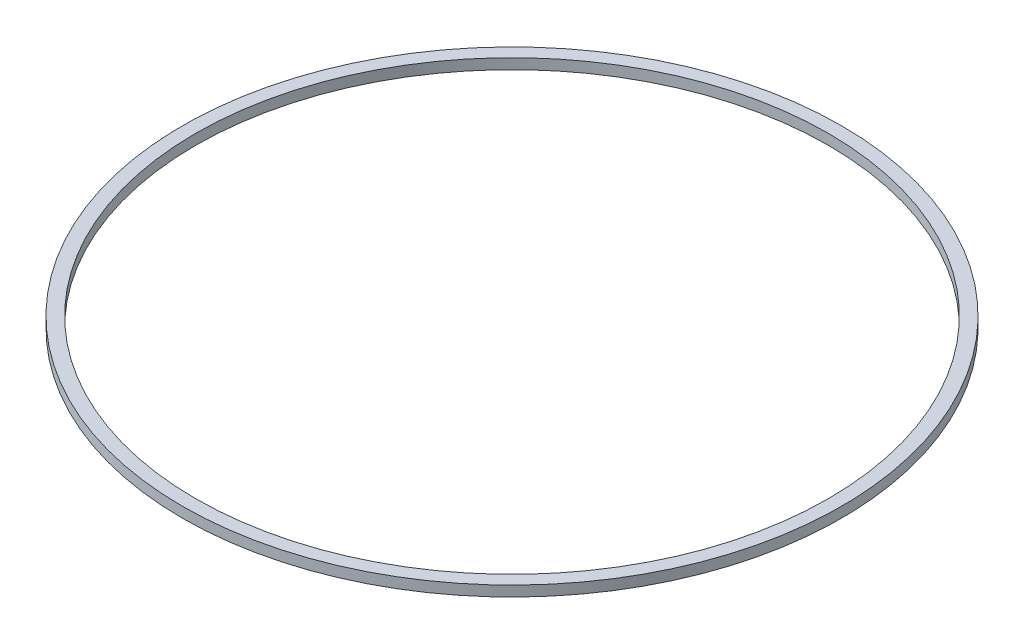
ISO-10303-21;
HEADER;
FILE_DESCRIPTION(('STEP AP214'),'2;1');
FILE_NAME('part.step','',(''),(''),'','','');
FILE_SCHEMA(('AUTOMOTIVE_DESIGN { 1 0 10303 214 1 1 1 1 }'));
ENDSEC;
DATA;
#1=APPLICATION_CONTEXT('core data for automotive mechanical design processes');
#2=APPLICATION_PROTOCOL_DEFINITION('international standard','automotive_design',2000,#1);
#3=PRODUCT_CONTEXT('',#1,'mechanical');
#4=PRODUCT('Part','Part','',(#3));
#5=PRODUCT_RELATED_PRODUCT_CATEGORY('part','',(#4));
#6=PRODUCT_DEFINITION_FORMATION('','',#4);
#7=PRODUCT_DEFINITION_CONTEXT('part definition',#1,'design');
#8=PRODUCT_DEFINITION('design','',#6,#7);
#9=PRODUCT_DEFINITION_SHAPE('','',#8);
#10=(LENGTH_UNIT() NAMED_UNIT(*) SI_UNIT(.MILLI.,.METRE.));
#11=(NAMED_UNIT(*) PLANE_ANGLE_UNIT() SI_UNIT($,.RADIAN.));
#12=(NAMED_UNIT(*) SI_UNIT($,.STERADIAN.) SOLID_ANGLE_UNIT());
#13=UNCERTAINTY_MEASURE_WITH_UNIT(LENGTH_MEASURE(1.E-05),#10,'distance_accuracy_value','');
#14=(GEOMETRIC_REPRESENTATION_CONTEXT(3) GLOBAL_UNCERTAINTY_ASSIGNED_CONTEXT((#13)) GLOBAL_UNIT_ASSIGNED_CONTEXT((#10,
#11,#12)) REPRESENTATION_CONTEXT('',''));
#15=CARTESIAN_POINT('',(0.,0.,0.));
#16=DIRECTION('',(0.,0.,1.));
#17=DIRECTION('',(1.,0.,0.));
#18=AXIS2_PLACEMENT_3D('',#15,#16,#17);
#19=CARTESIAN_POINT('',(0.,1.,0.));
#20=DIRECTION('',(0.,1.,0.));
#21=DIRECTION('',(0.,0.,1.));
#22=AXIS2_PLACEMENT_3D('',#19,#20,#21);
#23=PLANE('',#22);
#24=CARTESIAN_POINT('',(0.,1.,0.));
#25=DIRECTION('',(0.,1.,0.));
#26=DIRECTION('',(0.,0.,1.));
#27=AXIS2_PLACEMENT_3D('',#24,#25,#26);
#28=CIRCLE('',#27,63.5);
#29=CARTESIAN_POINT('',(0.,1.,63.5));
#30=VERTEX_POINT('',#29);
#31=EDGE_CURVE('E10',#30,#30,#28,.T.);
#32=ORIENTED_EDGE('',*,*,#31,.T.);
#33=EDGE_LOOP('',(#32));
#34=FACE_BOUND('',#33,.T.);
#35=CARTESIAN_POINT('',(0.,1.,0.));
#36=DIRECTION('',(0.,1.,0.));
#37=DIRECTION('',(0.,0.,1.));
#38=AXIS2_PLACEMENT_3D('',#35,#36,#37);
#39=CIRCLE('',#38,60.96);
#40=CARTESIAN_POINT('',(0.,1.,60.96));
#41=VERTEX_POINT('',#40);
#42=EDGE_CURVE('E43',#41,#41,#39,.T.);
#43=ORIENTED_EDGE('',*,*,#42,.F.);
#44=EDGE_LOOP('',(#43));
#45=FACE_BOUND('',#44,.T.);
#46=ADVANCED_FACE('F32',(#34,#45),#23,.T.);
#47=CARTESIAN_POINT('',(0.,-1.,0.));
#48=DIRECTION('',(0.,1.,0.));
#49=DIRECTION('',(0.,0.,1.));
#50=AXIS2_PLACEMENT_3D('',#47,#48,#49);
#51=PLANE('',#50);
#52=CARTESIAN_POINT('',(0.,-1.,0.));
#53=DIRECTION('',(0.,1.,0.));
#54=DIRECTION('',(0.,0.,1.));
#55=AXIS2_PLACEMENT_3D('',#52,#53,#54);
#56=CIRCLE('',#55,63.5);
#57=CARTESIAN_POINT('',(0.,-1.,63.5));
#58=VERTEX_POINT('',#57);
#59=EDGE_CURVE('E36',#58,#58,#56,.T.);
#60=ORIENTED_EDGE('',*,*,#59,.F.);
#61=EDGE_LOOP('',(#60));
#62=FACE_BOUND('',#61,.T.);
#63=CARTESIAN_POINT('',(0.,-1.,0.));
#64=DIRECTION('',(0.,1.,0.));
#65=DIRECTION('',(0.,0.,1.));
#66=AXIS2_PLACEMENT_3D('',#63,#64,#65);
#67=CIRCLE('',#66,60.96);
#68=CARTESIAN_POINT('',(0.,-1.,60.96));
#69=VERTEX_POINT('',#68);
#70=EDGE_CURVE('E45',#69,#69,#67,.T.);
#71=ORIENTED_EDGE('',*,*,#70,.T.);
#72=EDGE_LOOP('',(#71));
#73=FACE_BOUND('',#72,.T.);
#74=ADVANCED_FACE('F55',(#62,#73),#51,.F.);
#75=CARTESIAN_POINT('',(0.,1.,0.));
#76=DIRECTION('',(0.,-1.,0.));
#77=DIRECTION('',(0.,0.,-1.));
#78=AXIS2_PLACEMENT_3D('',#75,#76,#77);
#79=CYLINDRICAL_SURFACE('',#78,63.5);
#80=ORIENTED_EDGE('',*,*,#31,.F.);
#81=EDGE_LOOP('',(#80));
#82=FACE_BOUND('',#81,.T.);
#83=ORIENTED_EDGE('',*,*,#59,.T.);
#84=EDGE_LOOP('',(#83));
#85=FACE_BOUND('',#84,.T.);
#86=ADVANCED_FACE('F34',(#82,#85),#79,.T.);
#87=CARTESIAN_POINT('',(0.,1.,0.));
#88=DIRECTION('',(0.,-1.,0.));
#89=DIRECTION('',(0.,0.,-1.));
#90=AXIS2_PLACEMENT_3D('',#87,#88,#89);
#91=CYLINDRICAL_SURFACE('',#90,60.96);
#92=ORIENTED_EDGE('',*,*,#42,.T.);
#93=EDGE_LOOP('',(#92));
#94=FACE_BOUND('',#93,.T.);
#95=ORIENTED_EDGE('',*,*,#70,.F.);
#96=EDGE_LOOP('',(#95));
#97=FACE_BOUND('',#96,.T.);
#98=ADVANCED_FACE('F51',(#94,#97),#91,.F.);
#99=CLOSED_SHELL('',(#46,#74,#86,#98));
#100=MANIFOLD_SOLID_BREP('B2',#99);
#101=ADVANCED_BREP_SHAPE_REPRESENTATION('',(#18,#100),#14);
#102=SHAPE_DEFINITION_REPRESENTATION(#9,#101);
ENDSEC;
END-ISO-10303-21;
